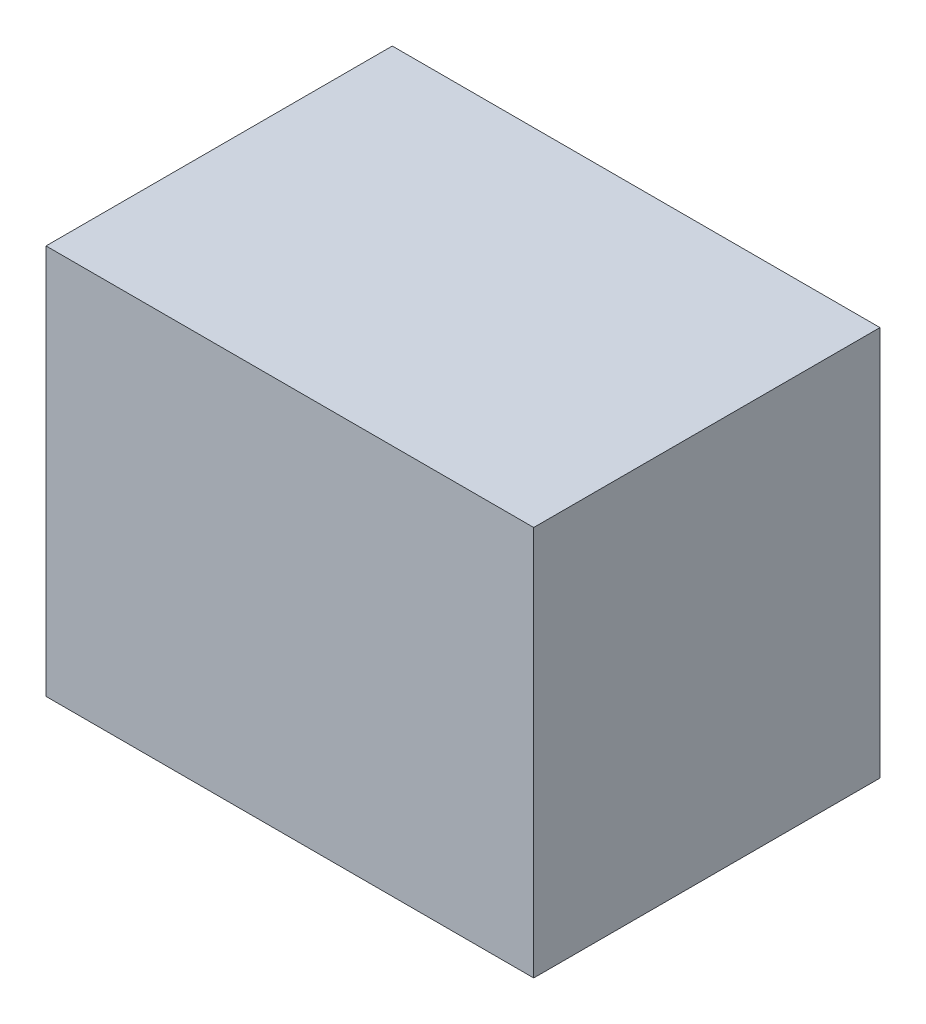
ISO-10303-21;
HEADER;
FILE_DESCRIPTION(('STEP AP214'),'2;1');
FILE_NAME('part.step','',(''),(''),'','','');
FILE_SCHEMA(('AUTOMOTIVE_DESIGN { 1 0 10303 214 1 1 1 1 }'));
ENDSEC;
DATA;
#1=APPLICATION_CONTEXT('core data for automotive mechanical design processes');
#2=APPLICATION_PROTOCOL_DEFINITION('international standard','automotive_design',2000,#1);
#3=PRODUCT_CONTEXT('',#1,'mechanical');
#4=PRODUCT('Part','Part','',(#3));
#5=PRODUCT_RELATED_PRODUCT_CATEGORY('part','',(#4));
#6=PRODUCT_DEFINITION_FORMATION('','',#4);
#7=PRODUCT_DEFINITION_CONTEXT('part definition',#1,'design');
#8=PRODUCT_DEFINITION('design','',#6,#7);
#9=PRODUCT_DEFINITION_SHAPE('','',#8);
#10=(LENGTH_UNIT() NAMED_UNIT(*) SI_UNIT(.MILLI.,.METRE.));
#11=(NAMED_UNIT(*) PLANE_ANGLE_UNIT() SI_UNIT($,.RADIAN.));
#12=(NAMED_UNIT(*) SI_UNIT($,.STERADIAN.) SOLID_ANGLE_UNIT());
#13=UNCERTAINTY_MEASURE_WITH_UNIT(LENGTH_MEASURE(1.E-05),#10,'distance_accuracy_value','');
#14=(GEOMETRIC_REPRESENTATION_CONTEXT(3) GLOBAL_UNCERTAINTY_ASSIGNED_CONTEXT((#13)) GLOBAL_UNIT_ASSIGNED_CONTEXT((#10,
#11,#12)) REPRESENTATION_CONTEXT('',''));
#15=CARTESIAN_POINT('',(0.,0.,0.));
#16=DIRECTION('',(0.,0.,1.));
#17=DIRECTION('',(1.,0.,0.));
#18=AXIS2_PLACEMENT_3D('',#15,#16,#17);
#19=CARTESIAN_POINT('',(11.5,38.5999999999999,-99.5312423743285));
#20=DIRECTION('',(1.,0.,0.));
#21=DIRECTION('',(0.,0.,-1.));
#22=AXIS2_PLACEMENT_3D('',#19,#20,#21);
#23=PLANE('',#22);
#24=DIRECTION('',(0.,-1.,0.));
#25=VECTOR('',#24,1.);
#26=CARTESIAN_POINT('',(11.5,38.5999999999999,-35.5));
#27=LINE('',#26,#25);
#28=CARTESIAN_POINT('',(11.5,78.6,-35.5));
#29=VERTEX_POINT('',#28);
#30=CARTESIAN_POINT('',(11.5,38.5999999999999,-35.5));
#31=VERTEX_POINT('',#30);
#32=EDGE_CURVE('E40',#29,#31,#27,.T.);
#33=ORIENTED_EDGE('',*,*,#32,.F.);
#34=DIRECTION('',(0.,0.,1.));
#35=VECTOR('',#34,1.);
#36=CARTESIAN_POINT('',(11.5,78.6,-99.5312423743285));
#37=LINE('',#36,#35);
#38=CARTESIAN_POINT('',(11.5,78.6,0.));
#39=VERTEX_POINT('',#38);
#40=EDGE_CURVE('E66',#29,#39,#37,.T.);
#41=ORIENTED_EDGE('',*,*,#40,.T.);
#42=DIRECTION('',(0.,1.,0.));
#43=VECTOR('',#42,1.);
#44=CARTESIAN_POINT('',(11.5,38.5999999999999,0.));
#45=LINE('',#44,#43);
#46=CARTESIAN_POINT('',(11.5,38.5999999999999,0.));
#47=VERTEX_POINT('',#46);
#48=EDGE_CURVE('E70',#47,#39,#45,.T.);
#49=ORIENTED_EDGE('',*,*,#48,.F.);
#50=DIRECTION('',(0.,0.,1.));
#51=VECTOR('',#50,1.);
#52=CARTESIAN_POINT('',(11.5,38.5999999999999,-99.5312423743285));
#53=LINE('',#52,#51);
#54=EDGE_CURVE('E92',#31,#47,#53,.T.);
#55=ORIENTED_EDGE('',*,*,#54,.F.);
#56=EDGE_LOOP('',(#33,#41,#49,#55));
#57=FACE_BOUND('',#56,.T.);
#58=ADVANCED_FACE('F32',(#57),#23,.T.);
#59=CARTESIAN_POINT('',(11.5,38.5999999999999,-99.5312423743285));
#60=DIRECTION('',(0.,-1.,0.));
#61=DIRECTION('',(1.,0.,0.));
#62=AXIS2_PLACEMENT_3D('',#59,#60,#61);
#63=PLANE('',#62);
#64=DIRECTION('',(-1.,0.,0.));
#65=VECTOR('',#64,1.);
#66=CARTESIAN_POINT('',(11.5,38.5999999999999,-35.5));
#67=LINE('',#66,#65);
#68=CARTESIAN_POINT('',(-38.5,38.5999999999999,-35.5));
#69=VERTEX_POINT('',#68);
#70=EDGE_CURVE('E104',#31,#69,#67,.T.);
#71=ORIENTED_EDGE('',*,*,#70,.F.);
#72=ORIENTED_EDGE('',*,*,#54,.T.);
#73=DIRECTION('',(1.,0.,0.));
#74=VECTOR('',#73,1.);
#75=CARTESIAN_POINT('',(11.5,38.5999999999999,0.));
#76=LINE('',#75,#74);
#77=CARTESIAN_POINT('',(-38.5,38.5999999999999,0.));
#78=VERTEX_POINT('',#77);
#79=EDGE_CURVE('E74',#78,#47,#76,.T.);
#80=ORIENTED_EDGE('',*,*,#79,.F.);
#81=DIRECTION('',(0.,0.,1.));
#82=VECTOR('',#81,1.);
#83=CARTESIAN_POINT('',(-38.5,38.5999999999999,-99.5312423743285));
#84=LINE('',#83,#82);
#85=EDGE_CURVE('E95',#69,#78,#84,.T.);
#86=ORIENTED_EDGE('',*,*,#85,.F.);
#87=EDGE_LOOP('',(#71,#72,#80,#86));
#88=FACE_BOUND('',#87,.T.);
#89=ADVANCED_FACE('F103',(#88),#63,.T.);
#90=CARTESIAN_POINT('',(-38.5,38.5999999999999,-99.5312423743285));
#91=DIRECTION('',(-1.,0.,0.));
#92=DIRECTION('',(0.,0.,1.));
#93=AXIS2_PLACEMENT_3D('',#90,#91,#92);
#94=PLANE('',#93);
#95=DIRECTION('',(0.,1.,0.));
#96=VECTOR('',#95,1.);
#97=CARTESIAN_POINT('',(-38.5,38.5999999999999,-35.5));
#98=LINE('',#97,#96);
#99=CARTESIAN_POINT('',(-38.5,78.6,-35.5));
#100=VERTEX_POINT('',#99);
#101=EDGE_CURVE('E94',#69,#100,#98,.T.);
#102=ORIENTED_EDGE('',*,*,#101,.F.);
#103=ORIENTED_EDGE('',*,*,#85,.T.);
#104=DIRECTION('',(0.,-1.,0.));
#105=VECTOR('',#104,1.);
#106=CARTESIAN_POINT('',(-38.5,38.5999999999999,0.));
#107=LINE('',#106,#105);
#108=CARTESIAN_POINT('',(-38.5,78.6,0.));
#109=VERTEX_POINT('',#108);
#110=EDGE_CURVE('E82',#109,#78,#107,.T.);
#111=ORIENTED_EDGE('',*,*,#110,.F.);
#112=DIRECTION('',(0.,0.,1.));
#113=VECTOR('',#112,1.);
#114=CARTESIAN_POINT('',(-38.5,78.6,-99.5312423743285));
#115=LINE('',#114,#113);
#116=EDGE_CURVE('E73',#100,#109,#115,.T.);
#117=ORIENTED_EDGE('',*,*,#116,.F.);
#118=EDGE_LOOP('',(#102,#103,#111,#117));
#119=FACE_BOUND('',#118,.T.);
#120=ADVANCED_FACE('F100',(#119),#94,.T.);
#121=CARTESIAN_POINT('',(11.5,78.6,-99.5312423743285));
#122=DIRECTION('',(0.,1.,0.));
#123=DIRECTION('',(0.,0.,1.));
#124=AXIS2_PLACEMENT_3D('',#121,#122,#123);
#125=PLANE('',#124);
#126=DIRECTION('',(1.,0.,0.));
#127=VECTOR('',#126,1.);
#128=CARTESIAN_POINT('',(11.5,78.6,-35.5));
#129=LINE('',#128,#127);
#130=EDGE_CURVE('E11',#100,#29,#129,.T.);
#131=ORIENTED_EDGE('',*,*,#130,.F.);
#132=ORIENTED_EDGE('',*,*,#116,.T.);
#133=DIRECTION('',(-1.,0.,0.));
#134=VECTOR('',#133,1.);
#135=CARTESIAN_POINT('',(11.5,78.6,0.));
#136=LINE('',#135,#134);
#137=EDGE_CURVE('E76',#39,#109,#136,.T.);
#138=ORIENTED_EDGE('',*,*,#137,.F.);
#139=ORIENTED_EDGE('',*,*,#40,.F.);
#140=EDGE_LOOP('',(#131,#132,#138,#139));
#141=FACE_BOUND('',#140,.T.);
#142=ADVANCED_FACE('F77',(#141),#125,.T.);
#143=CARTESIAN_POINT('',(11.5,78.6,0.));
#144=DIRECTION('',(0.,0.,1.));
#145=DIRECTION('',(1.,0.,0.));
#146=AXIS2_PLACEMENT_3D('',#143,#144,#145);
#147=PLANE('',#146);
#148=ORIENTED_EDGE('',*,*,#48,.T.);
#149=ORIENTED_EDGE('',*,*,#137,.T.);
#150=ORIENTED_EDGE('',*,*,#110,.T.);
#151=ORIENTED_EDGE('',*,*,#79,.T.);
#152=EDGE_LOOP('',(#148,#149,#150,#151));
#153=FACE_BOUND('',#152,.T.);
#154=ADVANCED_FACE('F84',(#153),#147,.T.);
#155=CARTESIAN_POINT('',(17.8,38.5999999999999,-35.5));
#156=DIRECTION('',(0.,0.,1.));
#157=DIRECTION('',(1.,0.,0.));
#158=AXIS2_PLACEMENT_3D('',#155,#156,#157);
#159=PLANE('',#158);
#160=ORIENTED_EDGE('',*,*,#32,.T.);
#161=ORIENTED_EDGE('',*,*,#70,.T.);
#162=ORIENTED_EDGE('',*,*,#101,.T.);
#163=ORIENTED_EDGE('',*,*,#130,.T.);
#164=EDGE_LOOP('',(#160,#161,#162,#163));
#165=FACE_BOUND('',#164,.T.);
#166=ADVANCED_FACE('F105',(#165),#159,.F.);
#167=CLOSED_SHELL('',(#58,#89,#120,#142,#154,#166));
#168=MANIFOLD_SOLID_BREP('B2',#167);
#169=ADVANCED_BREP_SHAPE_REPRESENTATION('',(#18,#168),#14);
#170=SHAPE_DEFINITION_REPRESENTATION(#9,#169);
ENDSEC;
END-ISO-10303-21;
